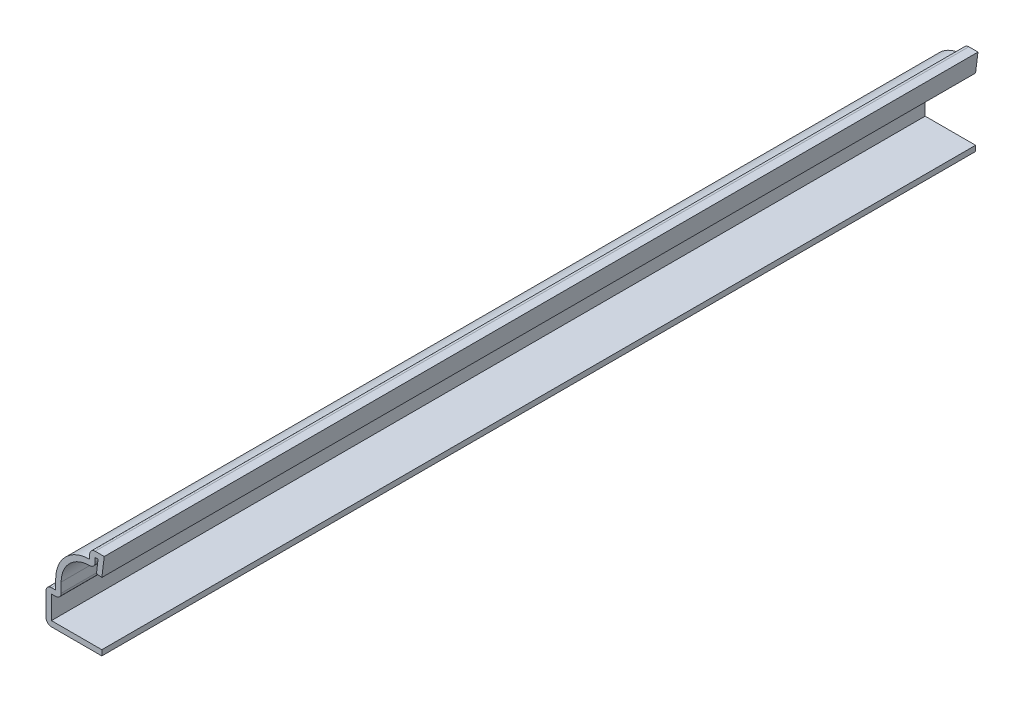
ISO-10303-21;
HEADER;
FILE_DESCRIPTION(('STEP AP214'),'2;1');
FILE_NAME('part.step','',(''),(''),'','','');
FILE_SCHEMA(('AUTOMOTIVE_DESIGN { 1 0 10303 214 1 1 1 1 }'));
ENDSEC;
DATA;
#1=APPLICATION_CONTEXT('core data for automotive mechanical design processes');
#2=APPLICATION_PROTOCOL_DEFINITION('international standard','automotive_design',2000,#1);
#3=PRODUCT_CONTEXT('',#1,'mechanical');
#4=PRODUCT('Part','Part','',(#3));
#5=PRODUCT_RELATED_PRODUCT_CATEGORY('part','',(#4));
#6=PRODUCT_DEFINITION_FORMATION('','',#4);
#7=PRODUCT_DEFINITION_CONTEXT('part definition',#1,'design');
#8=PRODUCT_DEFINITION('design','',#6,#7);
#9=PRODUCT_DEFINITION_SHAPE('','',#8);
#10=(LENGTH_UNIT() NAMED_UNIT(*) SI_UNIT(.MILLI.,.METRE.));
#11=(NAMED_UNIT(*) PLANE_ANGLE_UNIT() SI_UNIT($,.RADIAN.));
#12=(NAMED_UNIT(*) SI_UNIT($,.STERADIAN.) SOLID_ANGLE_UNIT());
#13=UNCERTAINTY_MEASURE_WITH_UNIT(LENGTH_MEASURE(1.E-05),#10,'distance_accuracy_value','');
#14=(GEOMETRIC_REPRESENTATION_CONTEXT(3) GLOBAL_UNCERTAINTY_ASSIGNED_CONTEXT((#13)) GLOBAL_UNIT_ASSIGNED_CONTEXT((#10,
#11,#12)) REPRESENTATION_CONTEXT('',''));
#15=CARTESIAN_POINT('',(0.,0.,0.));
#16=DIRECTION('',(0.,0.,1.));
#17=DIRECTION('',(1.,0.,0.));
#18=AXIS2_PLACEMENT_3D('',#15,#16,#17);
#19=CARTESIAN_POINT('',(-0.882135032398451,14.3977668790498,-142.875));
#20=DIRECTION('',(-0.992277876713668,0.124034734589208,0.));
#21=DIRECTION('',(-0.124034734589208,-0.992277876713668,0.));
#22=AXIS2_PLACEMENT_3D('',#19,#20,#21);
#23=PLANE('',#22);
#24=DIRECTION('',(-0.124034734589208,-0.992277876713668,0.));
#25=VECTOR('',#24,1.);
#26=CARTESIAN_POINT('',(-0.882135032398451,14.3977668790498,0.));
#27=LINE('',#26,#25);
#28=CARTESIAN_POINT('',(-1.00704339227968,13.3985,0.));
#29=VERTEX_POINT('',#28);
#30=CARTESIAN_POINT('',(-1.27901003239845,11.2227668790498,0.));
#31=VERTEX_POINT('',#30);
#32=EDGE_CURVE('E256',#29,#31,#27,.T.);
#33=ORIENTED_EDGE('',*,*,#32,.F.);
#34=DIRECTION('',(0.,0.,1.));
#35=VECTOR('',#34,1.);
#36=CARTESIAN_POINT('',(-1.00704339227968,13.3985,-142.875));
#37=LINE('',#36,#35);
#38=CARTESIAN_POINT('',(-1.00704339227968,13.3985,-142.875));
#39=VERTEX_POINT('',#38);
#40=EDGE_CURVE('E214',#39,#29,#37,.T.);
#41=ORIENTED_EDGE('',*,*,#40,.F.);
#42=DIRECTION('',(-0.124034734589208,-0.992277876713668,0.));
#43=VECTOR('',#42,1.);
#44=CARTESIAN_POINT('',(-0.882135032398451,14.3977668790498,-142.875));
#45=LINE('',#44,#43);
#46=CARTESIAN_POINT('',(-1.27901003239845,11.2227668790498,-142.875));
#47=VERTEX_POINT('',#46);
#48=EDGE_CURVE('E195',#39,#47,#45,.T.);
#49=ORIENTED_EDGE('',*,*,#48,.T.);
#50=DIRECTION('',(0.,0.,1.));
#51=VECTOR('',#50,1.);
#52=CARTESIAN_POINT('',(-1.27901003239845,11.2227668790498,-142.875));
#53=LINE('',#52,#51);
#54=EDGE_CURVE('E204',#47,#31,#53,.T.);
#55=ORIENTED_EDGE('',*,*,#54,.T.);
#56=EDGE_LOOP('',(#33,#41,#49,#55));
#57=FACE_BOUND('',#56,.T.);
#58=ADVANCED_FACE('F35',(#57),#23,.T.);
#59=CARTESIAN_POINT('',(-2.38125,13.3985,-142.875));
#60=DIRECTION('',(0.,-1.,0.));
#61=DIRECTION('',(1.,0.,0.));
#62=AXIS2_PLACEMENT_3D('',#59,#60,#61);
#63=PLANE('',#62);
#64=DIRECTION('',(1.,0.,0.));
#65=VECTOR('',#64,1.);
#66=CARTESIAN_POINT('',(-2.38125,13.3985,0.));
#67=LINE('',#66,#65);
#68=CARTESIAN_POINT('',(-1.49225,13.3985,0.));
#69=VERTEX_POINT('',#68);
#70=EDGE_CURVE('E215',#69,#29,#67,.T.);
#71=ORIENTED_EDGE('',*,*,#70,.F.);
#72=DIRECTION('',(0.,0.,1.));
#73=VECTOR('',#72,1.);
#74=CARTESIAN_POINT('',(-1.49225,13.3985,-142.875));
#75=LINE('',#74,#73);
#76=CARTESIAN_POINT('',(-1.49225,13.3985,-142.875));
#77=VERTEX_POINT('',#76);
#78=EDGE_CURVE('E296',#77,#69,#75,.T.);
#79=ORIENTED_EDGE('',*,*,#78,.F.);
#80=DIRECTION('',(1.,0.,0.));
#81=VECTOR('',#80,1.);
#82=CARTESIAN_POINT('',(-2.38125,13.3985,-142.875));
#83=LINE('',#82,#81);
#84=EDGE_CURVE('E212',#77,#39,#83,.T.);
#85=ORIENTED_EDGE('',*,*,#84,.T.);
#86=ORIENTED_EDGE('',*,*,#40,.T.);
#87=EDGE_LOOP('',(#71,#79,#85,#86));
#88=FACE_BOUND('',#87,.T.);
#89=ADVANCED_FACE('F385',(#88),#63,.T.);
#90=CARTESIAN_POINT('',(-1.49225,12.7,-142.875));
#91=DIRECTION('',(1.,0.,0.));
#92=DIRECTION('',(0.,1.,0.));
#93=AXIS2_PLACEMENT_3D('',#90,#91,#92);
#94=PLANE('',#93);
#95=DIRECTION('',(0.,1.,0.));
#96=VECTOR('',#95,1.);
#97=CARTESIAN_POINT('',(-1.49225,12.7,0.));
#98=LINE('',#97,#96);
#99=CARTESIAN_POINT('',(-1.49225,12.7,0.));
#100=VERTEX_POINT('',#99);
#101=EDGE_CURVE('E218',#100,#69,#98,.T.);
#102=ORIENTED_EDGE('',*,*,#101,.F.);
#103=DIRECTION('',(0.,0.,1.));
#104=VECTOR('',#103,1.);
#105=CARTESIAN_POINT('',(-1.49225,12.7,-142.875));
#106=LINE('',#105,#104);
#107=CARTESIAN_POINT('',(-1.49225,12.7,-142.875));
#108=VERTEX_POINT('',#107);
#109=EDGE_CURVE('E360',#100,#108,#106,.F.);
#110=ORIENTED_EDGE('',*,*,#109,.T.);
#111=DIRECTION('',(0.,1.,0.));
#112=VECTOR('',#111,1.);
#113=CARTESIAN_POINT('',(-1.49225,12.7,-142.875));
#114=LINE('',#113,#112);
#115=EDGE_CURVE('E253',#108,#77,#114,.T.);
#116=ORIENTED_EDGE('',*,*,#115,.T.);
#117=ORIENTED_EDGE('',*,*,#78,.T.);
#118=EDGE_LOOP('',(#102,#110,#116,#117));
#119=FACE_BOUND('',#118,.T.);
#120=ADVANCED_FACE('F390',(#119),#94,.T.);
#121=CARTESIAN_POINT('',(-2.38125,7.14375,-142.875));
#122=DIRECTION('',(0.,0.,1.));
#123=DIRECTION('',(1.,0.,0.));
#124=AXIS2_PLACEMENT_3D('',#121,#122,#123);
#125=CYLINDRICAL_SURFACE('',#124,4.66725);
#126=CARTESIAN_POINT('',(-2.38125,7.14375,-142.875));
#127=DIRECTION('',(0.,0.,1.));
#128=DIRECTION('',(1.,0.,0.));
#129=AXIS2_PLACEMENT_3D('',#126,#127,#128);
#130=CIRCLE('',#129,4.66725);
#131=CARTESIAN_POINT('',(-7.0485,7.14375,-142.875));
#132=VERTEX_POINT('',#131);
#133=CARTESIAN_POINT('',(-2.38125,11.811,-142.875));
#134=VERTEX_POINT('',#133);
#135=EDGE_CURVE('E250',#132,#134,#130,.F.);
#136=ORIENTED_EDGE('',*,*,#135,.T.);
#137=DIRECTION('',(0.,0.,1.));
#138=VECTOR('',#137,1.);
#139=CARTESIAN_POINT('',(-2.38125,11.811,-142.875));
#140=LINE('',#139,#138);
#141=CARTESIAN_POINT('',(-2.38125,11.811,0.));
#142=VERTEX_POINT('',#141);
#143=EDGE_CURVE('E357',#134,#142,#140,.T.);
#144=ORIENTED_EDGE('',*,*,#143,.T.);
#145=CARTESIAN_POINT('',(-2.38125,7.14375,0.));
#146=DIRECTION('',(0.,0.,1.));
#147=DIRECTION('',(1.,0.,0.));
#148=AXIS2_PLACEMENT_3D('',#145,#146,#147);
#149=CIRCLE('',#148,4.66725);
#150=CARTESIAN_POINT('',(-7.0485,7.14375,0.));
#151=VERTEX_POINT('',#150);
#152=EDGE_CURVE('E290',#151,#142,#149,.F.);
#153=ORIENTED_EDGE('',*,*,#152,.F.);
#154=DIRECTION('',(0.,0.,1.));
#155=VECTOR('',#154,1.);
#156=CARTESIAN_POINT('',(-7.0485,7.14375,-142.875));
#157=LINE('',#156,#155);
#158=EDGE_CURVE('E299',#132,#151,#157,.T.);
#159=ORIENTED_EDGE('',*,*,#158,.F.);
#160=EDGE_LOOP('',(#136,#144,#153,#159));
#161=FACE_BOUND('',#160,.T.);
#162=ADVANCED_FACE('F419',(#161),#125,.F.);
#163=CARTESIAN_POINT('',(-7.0485,5.55625,-142.875));
#164=DIRECTION('',(1.,0.,0.));
#165=DIRECTION('',(0.,0.,-1.));
#166=AXIS2_PLACEMENT_3D('',#163,#164,#165);
#167=PLANE('',#166);
#168=DIRECTION('',(0.,1.,0.));
#169=VECTOR('',#168,1.);
#170=CARTESIAN_POINT('',(-7.0485,5.55625,0.));
#171=LINE('',#170,#169);
#172=CARTESIAN_POINT('',(-7.0485,5.55625,0.));
#173=VERTEX_POINT('',#172);
#174=EDGE_CURVE('E288',#173,#151,#171,.T.);
#175=ORIENTED_EDGE('',*,*,#174,.F.);
#176=DIRECTION('',(0.,0.,1.));
#177=VECTOR('',#176,1.);
#178=CARTESIAN_POINT('',(-7.0485,5.55625,-142.875));
#179=LINE('',#178,#177);
#180=CARTESIAN_POINT('',(-7.0485,5.55625,-142.875));
#181=VERTEX_POINT('',#180);
#182=EDGE_CURVE('E355',#173,#181,#179,.F.);
#183=ORIENTED_EDGE('',*,*,#182,.T.);
#184=DIRECTION('',(0.,1.,0.));
#185=VECTOR('',#184,1.);
#186=CARTESIAN_POINT('',(-7.0485,5.55625,-142.875));
#187=LINE('',#186,#185);
#188=EDGE_CURVE('E248',#181,#132,#187,.T.);
#189=ORIENTED_EDGE('',*,*,#188,.T.);
#190=ORIENTED_EDGE('',*,*,#158,.T.);
#191=EDGE_LOOP('',(#175,#183,#189,#190));
#192=FACE_BOUND('',#191,.T.);
#193=ADVANCED_FACE('F423',(#192),#167,.T.);
#194=CARTESIAN_POINT('',(-9.525,4.66725,-142.875));
#195=DIRECTION('',(0.,-1.,0.));
#196=DIRECTION('',(0.,0.,-1.));
#197=AXIS2_PLACEMENT_3D('',#194,#195,#196);
#198=PLANE('',#197);
#199=DIRECTION('',(1.,0.,0.));
#200=VECTOR('',#199,1.);
#201=CARTESIAN_POINT('',(-9.525,4.66725,-142.875));
#202=LINE('',#201,#200);
#203=CARTESIAN_POINT('',(-8.636,4.66725,-142.875));
#204=VERTEX_POINT('',#203);
#205=CARTESIAN_POINT('',(-7.9375,4.66725,-142.875));
#206=VERTEX_POINT('',#205);
#207=EDGE_CURVE('E245',#204,#206,#202,.T.);
#208=ORIENTED_EDGE('',*,*,#207,.T.);
#209=DIRECTION('',(0.,0.,1.));
#210=VECTOR('',#209,1.);
#211=CARTESIAN_POINT('',(-7.9375,4.66725,-142.875));
#212=LINE('',#211,#210);
#213=CARTESIAN_POINT('',(-7.9375,4.66725,0.));
#214=VERTEX_POINT('',#213);
#215=EDGE_CURVE('E352',#206,#214,#212,.T.);
#216=ORIENTED_EDGE('',*,*,#215,.T.);
#217=DIRECTION('',(1.,0.,0.));
#218=VECTOR('',#217,1.);
#219=CARTESIAN_POINT('',(-9.525,4.66725,0.));
#220=LINE('',#219,#218);
#221=CARTESIAN_POINT('',(-8.636,4.66725,0.));
#222=VERTEX_POINT('',#221);
#223=EDGE_CURVE('E285',#222,#214,#220,.T.);
#224=ORIENTED_EDGE('',*,*,#223,.F.);
#225=DIRECTION('',(0.,0.,1.));
#226=VECTOR('',#225,1.);
#227=CARTESIAN_POINT('',(-8.636,4.66725,-142.875));
#228=LINE('',#227,#226);
#229=EDGE_CURVE('E302',#204,#222,#228,.T.);
#230=ORIENTED_EDGE('',*,*,#229,.F.);
#231=EDGE_LOOP('',(#208,#216,#224,#230));
#232=FACE_BOUND('',#231,.T.);
#233=ADVANCED_FACE('F430',(#232),#198,.T.);
#234=CARTESIAN_POINT('',(-8.636,0.,-142.875));
#235=DIRECTION('',(1.,0.,0.));
#236=DIRECTION('',(0.,0.,-1.));
#237=AXIS2_PLACEMENT_3D('',#234,#235,#236);
#238=PLANE('',#237);
#239=DIRECTION('',(0.,1.,0.));
#240=VECTOR('',#239,1.);
#241=CARTESIAN_POINT('',(-8.636,0.,0.));
#242=LINE('',#241,#240);
#243=CARTESIAN_POINT('',(-8.636,0.888999999999999,0.));
#244=VERTEX_POINT('',#243);
#245=EDGE_CURVE('E282',#244,#222,#242,.T.);
#246=ORIENTED_EDGE('',*,*,#245,.F.);
#247=DIRECTION('',(0.,0.,1.));
#248=VECTOR('',#247,1.);
#249=CARTESIAN_POINT('',(-8.636,0.888999999999999,-142.875));
#250=LINE('',#249,#248);
#251=CARTESIAN_POINT('',(-8.636,0.888999999999999,-142.875));
#252=VERTEX_POINT('',#251);
#253=EDGE_CURVE('E304',#252,#244,#250,.T.);
#254=ORIENTED_EDGE('',*,*,#253,.F.);
#255=DIRECTION('',(0.,1.,0.));
#256=VECTOR('',#255,1.);
#257=CARTESIAN_POINT('',(-8.636,0.,-142.875));
#258=LINE('',#257,#256);
#259=EDGE_CURVE('E242',#252,#204,#258,.T.);
#260=ORIENTED_EDGE('',*,*,#259,.T.);
#261=ORIENTED_EDGE('',*,*,#229,.T.);
#262=EDGE_LOOP('',(#246,#254,#260,#261));
#263=FACE_BOUND('',#262,.T.);
#264=ADVANCED_FACE('F435',(#263),#238,.T.);
#265=CARTESIAN_POINT('',(-0.396875,0.889,-142.875));
#266=DIRECTION('',(0.,1.,0.));
#267=DIRECTION('',(-1.,0.,0.));
#268=AXIS2_PLACEMENT_3D('',#265,#266,#267);
#269=PLANE('',#268);
#270=DIRECTION('',(-1.,0.,0.));
#271=VECTOR('',#270,1.);
#272=CARTESIAN_POINT('',(-0.396875,0.889,0.));
#273=LINE('',#272,#271);
#274=CARTESIAN_POINT('',(-0.396875,0.889,0.));
#275=VERTEX_POINT('',#274);
#276=EDGE_CURVE('E279',#275,#244,#273,.T.);
#277=ORIENTED_EDGE('',*,*,#276,.F.);
#278=DIRECTION('',(0.,0.,1.));
#279=VECTOR('',#278,1.);
#280=CARTESIAN_POINT('',(-0.396875,0.889,-142.875));
#281=LINE('',#280,#279);
#282=CARTESIAN_POINT('',(-0.396875,0.889,-142.875));
#283=VERTEX_POINT('',#282);
#284=EDGE_CURVE('E306',#283,#275,#281,.T.);
#285=ORIENTED_EDGE('',*,*,#284,.F.);
#286=DIRECTION('',(-1.,0.,0.));
#287=VECTOR('',#286,1.);
#288=CARTESIAN_POINT('',(-0.396875,0.889,-142.875));
#289=LINE('',#288,#287);
#290=EDGE_CURVE('E239',#283,#252,#289,.T.);
#291=ORIENTED_EDGE('',*,*,#290,.T.);
#292=ORIENTED_EDGE('',*,*,#253,.T.);
#293=EDGE_LOOP('',(#277,#285,#291,#292));
#294=FACE_BOUND('',#293,.T.);
#295=ADVANCED_FACE('F439',(#294),#269,.T.);
#296=CARTESIAN_POINT('',(-0.396875,0.889,-142.875));
#297=DIRECTION('',(-1.,0.,0.));
#298=DIRECTION('',(0.,-1.,0.));
#299=AXIS2_PLACEMENT_3D('',#296,#297,#298);
#300=PLANE('',#299);
#301=DIRECTION('',(0.,-1.,0.));
#302=VECTOR('',#301,1.);
#303=CARTESIAN_POINT('',(-0.396875,0.889,0.));
#304=LINE('',#303,#302);
#305=CARTESIAN_POINT('',(-0.396875,0.,0.));
#306=VERTEX_POINT('',#305);
#307=EDGE_CURVE('E277',#275,#306,#304,.T.);
#308=ORIENTED_EDGE('',*,*,#307,.T.);
#309=DIRECTION('',(0.,0.,1.));
#310=VECTOR('',#309,1.);
#311=CARTESIAN_POINT('',(-0.396875,0.,-142.875));
#312=LINE('',#311,#310);
#313=CARTESIAN_POINT('',(-0.396875,0.,-142.875));
#314=VERTEX_POINT('',#313);
#315=EDGE_CURVE('E308',#314,#306,#312,.T.);
#316=ORIENTED_EDGE('',*,*,#315,.F.);
#317=DIRECTION('',(0.,-1.,0.));
#318=VECTOR('',#317,1.);
#319=CARTESIAN_POINT('',(-0.396875,0.889,-142.875));
#320=LINE('',#319,#318);
#321=EDGE_CURVE('E237',#283,#314,#320,.T.);
#322=ORIENTED_EDGE('',*,*,#321,.F.);
#323=ORIENTED_EDGE('',*,*,#284,.T.);
#324=EDGE_LOOP('',(#308,#316,#322,#323));
#325=FACE_BOUND('',#324,.T.);
#326=ADVANCED_FACE('F443',(#325),#300,.F.);
#327=CARTESIAN_POINT('',(-0.396875,0.,-142.875));
#328=DIRECTION('',(0.,1.,0.));
#329=DIRECTION('',(-1.,0.,0.));
#330=AXIS2_PLACEMENT_3D('',#327,#328,#329);
#331=PLANE('',#330);
#332=DIRECTION('',(-1.,0.,0.));
#333=VECTOR('',#332,1.);
#334=CARTESIAN_POINT('',(-0.396875,0.,0.));
#335=LINE('',#334,#333);
#336=CARTESIAN_POINT('',(-8.636,0.,0.));
#337=VERTEX_POINT('',#336);
#338=EDGE_CURVE('E274',#306,#337,#335,.T.);
#339=ORIENTED_EDGE('',*,*,#338,.T.);
#340=DIRECTION('',(0.,0.,1.));
#341=VECTOR('',#340,1.);
#342=CARTESIAN_POINT('',(-8.636,0.,-142.875));
#343=LINE('',#342,#341);
#344=CARTESIAN_POINT('',(-8.636,0.,-142.875));
#345=VERTEX_POINT('',#344);
#346=EDGE_CURVE('E338',#337,#345,#343,.F.);
#347=ORIENTED_EDGE('',*,*,#346,.T.);
#348=DIRECTION('',(-1.,0.,0.));
#349=VECTOR('',#348,1.);
#350=CARTESIAN_POINT('',(-0.396875,0.,-142.875));
#351=LINE('',#350,#349);
#352=EDGE_CURVE('E235',#314,#345,#351,.T.);
#353=ORIENTED_EDGE('',*,*,#352,.F.);
#354=ORIENTED_EDGE('',*,*,#315,.T.);
#355=EDGE_LOOP('',(#339,#347,#353,#354));
#356=FACE_BOUND('',#355,.T.);
#357=ADVANCED_FACE('F484',(#356),#331,.F.);
#358=CARTESIAN_POINT('',(-9.525,0.,-142.875));
#359=DIRECTION('',(1.,0.,0.));
#360=DIRECTION('',(0.,0.,-1.));
#361=AXIS2_PLACEMENT_3D('',#358,#359,#360);
#362=PLANE('',#361);
#363=DIRECTION('',(0.,1.,0.));
#364=VECTOR('',#363,1.);
#365=CARTESIAN_POINT('',(-9.525,0.,-142.875));
#366=LINE('',#365,#364);
#367=CARTESIAN_POINT('',(-9.525,0.888999999999999,-142.875));
#368=VERTEX_POINT('',#367);
#369=CARTESIAN_POINT('',(-9.525,4.66725,-142.875));
#370=VERTEX_POINT('',#369);
#371=EDGE_CURVE('E232',#368,#370,#366,.T.);
#372=ORIENTED_EDGE('',*,*,#371,.F.);
#373=DIRECTION('',(0.,0.,1.));
#374=VECTOR('',#373,1.);
#375=CARTESIAN_POINT('',(-9.525,0.888999999999999,-142.875));
#376=LINE('',#375,#374);
#377=CARTESIAN_POINT('',(-9.525,0.888999999999999,0.));
#378=VERTEX_POINT('',#377);
#379=EDGE_CURVE('E325',#368,#378,#376,.T.);
#380=ORIENTED_EDGE('',*,*,#379,.T.);
#381=DIRECTION('',(0.,1.,0.));
#382=VECTOR('',#381,1.);
#383=CARTESIAN_POINT('',(-9.525,0.,0.));
#384=LINE('',#383,#382);
#385=CARTESIAN_POINT('',(-9.525,4.66725,0.));
#386=VERTEX_POINT('',#385);
#387=EDGE_CURVE('E271',#378,#386,#384,.T.);
#388=ORIENTED_EDGE('',*,*,#387,.T.);
#389=DIRECTION('',(0.,0.,1.));
#390=VECTOR('',#389,1.);
#391=CARTESIAN_POINT('',(-9.525,4.66725,-142.875));
#392=LINE('',#391,#390);
#393=EDGE_CURVE('E295',#386,#370,#392,.F.);
#394=ORIENTED_EDGE('',*,*,#393,.T.);
#395=EDGE_LOOP('',(#372,#380,#388,#394));
#396=FACE_BOUND('',#395,.T.);
#397=ADVANCED_FACE('F451',(#396),#362,.F.);
#398=CARTESIAN_POINT('',(-9.525,5.55625,-142.875));
#399=DIRECTION('',(0.,-1.,0.));
#400=DIRECTION('',(0.,0.,-1.));
#401=AXIS2_PLACEMENT_3D('',#398,#399,#400);
#402=PLANE('',#401);
#403=DIRECTION('',(1.,0.,0.));
#404=VECTOR('',#403,1.);
#405=CARTESIAN_POINT('',(-9.525,5.55625,-142.875));
#406=LINE('',#405,#404);
#407=CARTESIAN_POINT('',(-8.636,5.55625,-142.875));
#408=VERTEX_POINT('',#407);
#409=CARTESIAN_POINT('',(-7.9375,5.55625,-142.875));
#410=VERTEX_POINT('',#409);
#411=EDGE_CURVE('E230',#408,#410,#406,.T.);
#412=ORIENTED_EDGE('',*,*,#411,.F.);
#413=DIRECTION('',(0.,0.,1.));
#414=VECTOR('',#413,1.);
#415=CARTESIAN_POINT('',(-8.636,5.55625,-142.875));
#416=LINE('',#415,#414);
#417=CARTESIAN_POINT('',(-8.636,5.55625,0.));
#418=VERTEX_POINT('',#417);
#419=EDGE_CURVE('E349',#408,#418,#416,.T.);
#420=ORIENTED_EDGE('',*,*,#419,.T.);
#421=DIRECTION('',(1.,0.,0.));
#422=VECTOR('',#421,1.);
#423=CARTESIAN_POINT('',(-9.525,5.55625,0.));
#424=LINE('',#423,#422);
#425=CARTESIAN_POINT('',(-7.9375,5.55625,0.));
#426=VERTEX_POINT('',#425);
#427=EDGE_CURVE('E269',#418,#426,#424,.T.);
#428=ORIENTED_EDGE('',*,*,#427,.T.);
#429=DIRECTION('',(0.,0.,1.));
#430=VECTOR('',#429,1.);
#431=CARTESIAN_POINT('',(-7.9375,5.55625,-142.875));
#432=LINE('',#431,#430);
#433=EDGE_CURVE('E311',#410,#426,#432,.T.);
#434=ORIENTED_EDGE('',*,*,#433,.F.);
#435=EDGE_LOOP('',(#412,#420,#428,#434));
#436=FACE_BOUND('',#435,.T.);
#437=ADVANCED_FACE('F460',(#436),#402,.F.);
#438=CARTESIAN_POINT('',(-7.9375,5.55625,-142.875));
#439=DIRECTION('',(1.,0.,0.));
#440=DIRECTION('',(0.,0.,-1.));
#441=AXIS2_PLACEMENT_3D('',#438,#439,#440);
#442=PLANE('',#441);
#443=DIRECTION('',(0.,1.,0.));
#444=VECTOR('',#443,1.);
#445=CARTESIAN_POINT('',(-7.9375,5.55625,0.));
#446=LINE('',#445,#444);
#447=CARTESIAN_POINT('',(-7.9375,7.14375,0.));
#448=VERTEX_POINT('',#447);
#449=EDGE_CURVE('E267',#426,#448,#446,.T.);
#450=ORIENTED_EDGE('',*,*,#449,.T.);
#451=DIRECTION('',(0.,0.,1.));
#452=VECTOR('',#451,1.);
#453=CARTESIAN_POINT('',(-7.9375,7.14375,-142.875));
#454=LINE('',#453,#452);
#455=CARTESIAN_POINT('',(-7.9375,7.14375,-142.875));
#456=VERTEX_POINT('',#455);
#457=EDGE_CURVE('E314',#456,#448,#454,.T.);
#458=ORIENTED_EDGE('',*,*,#457,.F.);
#459=DIRECTION('',(0.,1.,0.));
#460=VECTOR('',#459,1.);
#461=CARTESIAN_POINT('',(-7.9375,5.55625,-142.875));
#462=LINE('',#461,#460);
#463=EDGE_CURVE('E228',#410,#456,#462,.T.);
#464=ORIENTED_EDGE('',*,*,#463,.F.);
#465=ORIENTED_EDGE('',*,*,#433,.T.);
#466=EDGE_LOOP('',(#450,#458,#464,#465));
#467=FACE_BOUND('',#466,.T.);
#468=ADVANCED_FACE('F467',(#467),#442,.F.);
#469=CARTESIAN_POINT('',(-2.38125,7.14375,-142.875));
#470=DIRECTION('',(0.,0.,1.));
#471=DIRECTION('',(1.,0.,0.));
#472=AXIS2_PLACEMENT_3D('',#469,#470,#471);
#473=CYLINDRICAL_SURFACE('',#472,5.55625);
#474=CARTESIAN_POINT('',(-2.38125,7.14375,0.));
#475=DIRECTION('',(0.,0.,-1.));
#476=DIRECTION('',(-1.,0.,0.));
#477=AXIS2_PLACEMENT_3D('',#474,#475,#476);
#478=CIRCLE('',#477,5.55625);
#479=CARTESIAN_POINT('',(-2.38125,12.7,0.));
#480=VERTEX_POINT('',#479);
#481=EDGE_CURVE('E265',#448,#480,#478,.T.);
#482=ORIENTED_EDGE('',*,*,#481,.T.);
#483=DIRECTION('',(0.,0.,1.));
#484=VECTOR('',#483,1.);
#485=CARTESIAN_POINT('',(-2.38125,12.7,-142.875));
#486=LINE('',#485,#484);
#487=CARTESIAN_POINT('',(-2.38125,12.7,-142.875));
#488=VERTEX_POINT('',#487);
#489=EDGE_CURVE('E317',#488,#480,#486,.T.);
#490=ORIENTED_EDGE('',*,*,#489,.F.);
#491=CARTESIAN_POINT('',(-2.38125,7.14375,-142.875));
#492=DIRECTION('',(0.,0.,-1.));
#493=DIRECTION('',(-1.,0.,0.));
#494=AXIS2_PLACEMENT_3D('',#491,#492,#493);
#495=CIRCLE('',#494,5.55625);
#496=EDGE_CURVE('E226',#456,#488,#495,.T.);
#497=ORIENTED_EDGE('',*,*,#496,.F.);
#498=ORIENTED_EDGE('',*,*,#457,.T.);
#499=EDGE_LOOP('',(#482,#490,#497,#498));
#500=FACE_BOUND('',#499,.T.);
#501=ADVANCED_FACE('F470',(#500),#473,.T.);
#502=CARTESIAN_POINT('',(-2.38125,12.7,-142.875));
#503=DIRECTION('',(1.,0.,0.));
#504=DIRECTION('',(0.,1.,0.));
#505=AXIS2_PLACEMENT_3D('',#502,#503,#504);
#506=PLANE('',#505);
#507=DIRECTION('',(0.,1.,0.));
#508=VECTOR('',#507,1.);
#509=CARTESIAN_POINT('',(-2.38125,12.7,0.));
#510=LINE('',#509,#508);
#511=CARTESIAN_POINT('',(-2.38125,13.3985,0.));
#512=VERTEX_POINT('',#511);
#513=EDGE_CURVE('E263',#480,#512,#510,.T.);
#514=ORIENTED_EDGE('',*,*,#513,.T.);
#515=DIRECTION('',(0.,0.,1.));
#516=VECTOR('',#515,1.);
#517=CARTESIAN_POINT('',(-2.38125,13.3985,-142.875));
#518=LINE('',#517,#516);
#519=CARTESIAN_POINT('',(-2.38125,13.3985,-142.875));
#520=VERTEX_POINT('',#519);
#521=EDGE_CURVE('E11',#512,#520,#518,.F.);
#522=ORIENTED_EDGE('',*,*,#521,.T.);
#523=DIRECTION('',(0.,1.,0.));
#524=VECTOR('',#523,1.);
#525=CARTESIAN_POINT('',(-2.38125,12.7,-142.875));
#526=LINE('',#525,#524);
#527=EDGE_CURVE('E224',#488,#520,#526,.T.);
#528=ORIENTED_EDGE('',*,*,#527,.F.);
#529=ORIENTED_EDGE('',*,*,#489,.T.);
#530=EDGE_LOOP('',(#514,#522,#528,#529));
#531=FACE_BOUND('',#530,.T.);
#532=ADVANCED_FACE('F382',(#531),#506,.F.);
#533=CARTESIAN_POINT('',(-2.38125,14.2875,-142.875));
#534=DIRECTION('',(0.,-1.,0.));
#535=DIRECTION('',(1.,0.,0.));
#536=AXIS2_PLACEMENT_3D('',#533,#534,#535);
#537=PLANE('',#536);
#538=DIRECTION('',(1.,0.,0.));
#539=VECTOR('',#538,1.);
#540=CARTESIAN_POINT('',(-2.38125,14.2875,-142.875));
#541=LINE('',#540,#539);
#542=CARTESIAN_POINT('',(-1.49225,14.2875,-142.875));
#543=VERTEX_POINT('',#542);
#544=CARTESIAN_POINT('',(0.,14.2875,-142.875));
#545=VERTEX_POINT('',#544);
#546=EDGE_CURVE('E222',#543,#545,#541,.T.);
#547=ORIENTED_EDGE('',*,*,#546,.F.);
#548=DIRECTION('',(0.,0.,1.));
#549=VECTOR('',#548,1.);
#550=CARTESIAN_POINT('',(-1.49225,14.2875,-142.875));
#551=LINE('',#550,#549);
#552=CARTESIAN_POINT('',(-1.49225,14.2875,0.));
#553=VERTEX_POINT('',#552);
#554=EDGE_CURVE('E43',#543,#553,#551,.T.);
#555=ORIENTED_EDGE('',*,*,#554,.T.);
#556=DIRECTION('',(1.,0.,0.));
#557=VECTOR('',#556,1.);
#558=CARTESIAN_POINT('',(-2.38125,14.2875,0.));
#559=LINE('',#558,#557);
#560=CARTESIAN_POINT('',(0.,14.2875,0.));
#561=VERTEX_POINT('',#560);
#562=EDGE_CURVE('E261',#553,#561,#559,.T.);
#563=ORIENTED_EDGE('',*,*,#562,.T.);
#564=DIRECTION('',(0.,0.,1.));
#565=VECTOR('',#564,1.);
#566=CARTESIAN_POINT('',(0.,14.2875,-142.875));
#567=LINE('',#566,#565);
#568=EDGE_CURVE('E320',#545,#561,#567,.T.);
#569=ORIENTED_EDGE('',*,*,#568,.F.);
#570=EDGE_LOOP('',(#547,#555,#563,#569));
#571=FACE_BOUND('',#570,.T.);
#572=ADVANCED_FACE('F365',(#571),#537,.F.);
#573=CARTESIAN_POINT('',(0.,14.2875,-142.875));
#574=DIRECTION('',(-0.992277876713668,0.124034734589208,0.));
#575=DIRECTION('',(-0.124034734589208,-0.992277876713668,0.));
#576=AXIS2_PLACEMENT_3D('',#573,#574,#575);
#577=PLANE('',#576);
#578=DIRECTION('',(-0.124034734589208,-0.992277876713668,0.));
#579=VECTOR('',#578,1.);
#580=CARTESIAN_POINT('',(0.,14.2875,0.));
#581=LINE('',#580,#579);
#582=CARTESIAN_POINT('',(-0.396875,11.1125,0.));
#583=VERTEX_POINT('',#582);
#584=EDGE_CURVE('E259',#561,#583,#581,.T.);
#585=ORIENTED_EDGE('',*,*,#584,.T.);
#586=DIRECTION('',(0.,0.,1.));
#587=VECTOR('',#586,1.);
#588=CARTESIAN_POINT('',(-0.396875,11.1125,-142.875));
#589=LINE('',#588,#587);
#590=CARTESIAN_POINT('',(-0.396875,11.1125,-142.875));
#591=VERTEX_POINT('',#590);
#592=EDGE_CURVE('E211',#591,#583,#589,.T.);
#593=ORIENTED_EDGE('',*,*,#592,.F.);
#594=DIRECTION('',(-0.124034734589208,-0.992277876713668,0.));
#595=VECTOR('',#594,1.);
#596=CARTESIAN_POINT('',(0.,14.2875,-142.875));
#597=LINE('',#596,#595);
#598=EDGE_CURVE('E198',#545,#591,#597,.T.);
#599=ORIENTED_EDGE('',*,*,#598,.F.);
#600=ORIENTED_EDGE('',*,*,#568,.T.);
#601=EDGE_LOOP('',(#585,#593,#599,#600));
#602=FACE_BOUND('',#601,.T.);
#603=ADVANCED_FACE('F374',(#602),#577,.F.);
#604=CARTESIAN_POINT('',(-0.396875,11.1125,-142.875));
#605=DIRECTION('',(0.124034734589209,0.992277876713668,0.));
#606=DIRECTION('',(-0.992277876713668,0.124034734589209,0.));
#607=AXIS2_PLACEMENT_3D('',#604,#605,#606);
#608=PLANE('',#607);
#609=DIRECTION('',(-0.992277876713668,0.124034734589209,0.));
#610=VECTOR('',#609,1.);
#611=CARTESIAN_POINT('',(-0.396875,11.1125,0.));
#612=LINE('',#611,#610);
#613=EDGE_CURVE('E207',#583,#31,#612,.T.);
#614=ORIENTED_EDGE('',*,*,#613,.T.);
#615=ORIENTED_EDGE('',*,*,#54,.F.);
#616=DIRECTION('',(-0.992277876713668,0.124034734589209,0.));
#617=VECTOR('',#616,1.);
#618=CARTESIAN_POINT('',(-0.396875,11.1125,-142.875));
#619=LINE('',#618,#617);
#620=EDGE_CURVE('E189',#591,#47,#619,.T.);
#621=ORIENTED_EDGE('',*,*,#620,.F.);
#622=ORIENTED_EDGE('',*,*,#592,.T.);
#623=EDGE_LOOP('',(#614,#615,#621,#622));
#624=FACE_BOUND('',#623,.T.);
#625=ADVANCED_FACE('F205',(#624),#608,.F.);
#626=CARTESIAN_POINT('',(-2.38125,7.14375,-142.875));
#627=DIRECTION('',(0.,0.,-1.));
#628=DIRECTION('',(-1.,0.,0.));
#629=AXIS2_PLACEMENT_3D('',#626,#627,#628);
#630=PLANE('',#629);
#631=ORIENTED_EDGE('',*,*,#352,.T.);
#632=CARTESIAN_POINT('',(-8.636,0.888999999999999,-142.875));
#633=DIRECTION('',(0.,0.,-1.));
#634=DIRECTION('',(-1.,0.,0.));
#635=AXIS2_PLACEMENT_3D('',#632,#633,#634);
#636=CIRCLE('',#635,0.889);
#637=EDGE_CURVE('E347',#345,#368,#636,.T.);
#638=ORIENTED_EDGE('',*,*,#637,.T.);
#639=ORIENTED_EDGE('',*,*,#371,.T.);
#640=CARTESIAN_POINT('',(-8.636,4.66725,-142.875));
#641=DIRECTION('',(0.,0.,-1.));
#642=DIRECTION('',(-1.,0.,0.));
#643=AXIS2_PLACEMENT_3D('',#640,#641,#642);
#644=CIRCLE('',#643,0.889);
#645=EDGE_CURVE('E345',#370,#408,#644,.T.);
#646=ORIENTED_EDGE('',*,*,#645,.T.);
#647=ORIENTED_EDGE('',*,*,#411,.T.);
#648=ORIENTED_EDGE('',*,*,#463,.T.);
#649=ORIENTED_EDGE('',*,*,#496,.T.);
#650=ORIENTED_EDGE('',*,*,#527,.T.);
#651=CARTESIAN_POINT('',(-1.49225,13.3985,-142.875));
#652=DIRECTION('',(0.,0.,-1.));
#653=DIRECTION('',(-1.,0.,0.));
#654=AXIS2_PLACEMENT_3D('',#651,#652,#653);
#655=CIRCLE('',#654,0.889);
#656=EDGE_CURVE('E50',#520,#543,#655,.T.);
#657=ORIENTED_EDGE('',*,*,#656,.T.);
#658=ORIENTED_EDGE('',*,*,#546,.T.);
#659=ORIENTED_EDGE('',*,*,#598,.T.);
#660=ORIENTED_EDGE('',*,*,#620,.T.);
#661=ORIENTED_EDGE('',*,*,#48,.F.);
#662=ORIENTED_EDGE('',*,*,#84,.F.);
#663=ORIENTED_EDGE('',*,*,#115,.F.);
#664=CARTESIAN_POINT('',(-2.38125,12.7,-142.875));
#665=DIRECTION('',(0.,0.,-1.));
#666=DIRECTION('',(-1.,0.,0.));
#667=AXIS2_PLACEMENT_3D('',#664,#665,#666);
#668=CIRCLE('',#667,0.889);
#669=EDGE_CURVE('E341',#108,#134,#668,.T.);
#670=ORIENTED_EDGE('',*,*,#669,.T.);
#671=ORIENTED_EDGE('',*,*,#135,.F.);
#672=ORIENTED_EDGE('',*,*,#188,.F.);
#673=CARTESIAN_POINT('',(-7.9375,5.55625,-142.875));
#674=DIRECTION('',(0.,0.,-1.));
#675=DIRECTION('',(-1.,0.,0.));
#676=AXIS2_PLACEMENT_3D('',#673,#674,#675);
#677=CIRCLE('',#676,0.889);
#678=EDGE_CURVE('E343',#181,#206,#677,.T.);
#679=ORIENTED_EDGE('',*,*,#678,.T.);
#680=ORIENTED_EDGE('',*,*,#207,.F.);
#681=ORIENTED_EDGE('',*,*,#259,.F.);
#682=ORIENTED_EDGE('',*,*,#290,.F.);
#683=ORIENTED_EDGE('',*,*,#321,.T.);
#684=EDGE_LOOP('',(#631,#638,#639,#646,#647,#648,#649,#650,#657,#658,#659,#660,#661,#662,#663,
#670,#671,#672,#679,#680,#681,#682,#683));
#685=FACE_BOUND('',#684,.T.);
#686=ADVANCED_FACE('F192',(#685),#630,.T.);
#687=CARTESIAN_POINT('',(-2.38125,7.14375,0.));
#688=DIRECTION('',(0.,0.,-1.));
#689=DIRECTION('',(-1.,0.,0.));
#690=AXIS2_PLACEMENT_3D('',#687,#688,#689);
#691=PLANE('',#690);
#692=ORIENTED_EDGE('',*,*,#387,.F.);
#693=CARTESIAN_POINT('',(-8.636,0.888999999999999,0.));
#694=DIRECTION('',(0.,0.,-1.));
#695=DIRECTION('',(-1.,0.,0.));
#696=AXIS2_PLACEMENT_3D('',#693,#694,#695);
#697=CIRCLE('',#696,0.889);
#698=EDGE_CURVE('E336',#378,#337,#697,.F.);
#699=ORIENTED_EDGE('',*,*,#698,.T.);
#700=ORIENTED_EDGE('',*,*,#338,.F.);
#701=ORIENTED_EDGE('',*,*,#307,.F.);
#702=ORIENTED_EDGE('',*,*,#276,.T.);
#703=ORIENTED_EDGE('',*,*,#245,.T.);
#704=ORIENTED_EDGE('',*,*,#223,.T.);
#705=CARTESIAN_POINT('',(-7.9375,5.55625,0.));
#706=DIRECTION('',(0.,0.,-1.));
#707=DIRECTION('',(-1.,0.,0.));
#708=AXIS2_PLACEMENT_3D('',#705,#706,#707);
#709=CIRCLE('',#708,0.889);
#710=EDGE_CURVE('E332',#214,#173,#709,.F.);
#711=ORIENTED_EDGE('',*,*,#710,.T.);
#712=ORIENTED_EDGE('',*,*,#174,.T.);
#713=ORIENTED_EDGE('',*,*,#152,.T.);
#714=CARTESIAN_POINT('',(-2.38125,12.7,0.));
#715=DIRECTION('',(0.,0.,-1.));
#716=DIRECTION('',(-1.,0.,0.));
#717=AXIS2_PLACEMENT_3D('',#714,#715,#716);
#718=CIRCLE('',#717,0.889);
#719=EDGE_CURVE('E330',#142,#100,#718,.F.);
#720=ORIENTED_EDGE('',*,*,#719,.T.);
#721=ORIENTED_EDGE('',*,*,#101,.T.);
#722=ORIENTED_EDGE('',*,*,#70,.T.);
#723=ORIENTED_EDGE('',*,*,#32,.T.);
#724=ORIENTED_EDGE('',*,*,#613,.F.);
#725=ORIENTED_EDGE('',*,*,#584,.F.);
#726=ORIENTED_EDGE('',*,*,#562,.F.);
#727=CARTESIAN_POINT('',(-1.49225,13.3985,0.));
#728=DIRECTION('',(0.,0.,-1.));
#729=DIRECTION('',(-1.,0.,0.));
#730=AXIS2_PLACEMENT_3D('',#727,#728,#729);
#731=CIRCLE('',#730,0.889);
#732=EDGE_CURVE('E328',#553,#512,#731,.F.);
#733=ORIENTED_EDGE('',*,*,#732,.T.);
#734=ORIENTED_EDGE('',*,*,#513,.F.);
#735=ORIENTED_EDGE('',*,*,#481,.F.);
#736=ORIENTED_EDGE('',*,*,#449,.F.);
#737=ORIENTED_EDGE('',*,*,#427,.F.);
#738=CARTESIAN_POINT('',(-8.636,4.66725,0.));
#739=DIRECTION('',(0.,0.,-1.));
#740=DIRECTION('',(-1.,0.,0.));
#741=AXIS2_PLACEMENT_3D('',#738,#739,#740);
#742=CIRCLE('',#741,0.889);
#743=EDGE_CURVE('E334',#418,#386,#742,.F.);
#744=ORIENTED_EDGE('',*,*,#743,.T.);
#745=EDGE_LOOP('',(#692,#699,#700,#701,#702,#703,#704,#711,#712,#713,#720,#721,#722,#723,#724,
#725,#726,#733,#734,#735,#736,#737,#744));
#746=FACE_BOUND('',#745,.T.);
#747=ADVANCED_FACE('F371',(#746),#691,.F.);
#748=CARTESIAN_POINT('',(-8.636,0.888999999999999,-142.875));
#749=DIRECTION('',(0.,0.,1.));
#750=DIRECTION('',(1.,0.,0.));
#751=AXIS2_PLACEMENT_3D('',#748,#749,#750);
#752=CYLINDRICAL_SURFACE('',#751,0.889);
#753=ORIENTED_EDGE('',*,*,#637,.F.);
#754=ORIENTED_EDGE('',*,*,#346,.F.);
#755=ORIENTED_EDGE('',*,*,#698,.F.);
#756=ORIENTED_EDGE('',*,*,#379,.F.);
#757=EDGE_LOOP('',(#753,#754,#755,#756));
#758=FACE_BOUND('',#757,.T.);
#759=ADVANCED_FACE('F394',(#758),#752,.T.);
#760=CARTESIAN_POINT('',(-8.636,4.66725,-142.875));
#761=DIRECTION('',(0.,0.,1.));
#762=DIRECTION('',(1.,0.,0.));
#763=AXIS2_PLACEMENT_3D('',#760,#761,#762);
#764=CYLINDRICAL_SURFACE('',#763,0.889);
#765=ORIENTED_EDGE('',*,*,#645,.F.);
#766=ORIENTED_EDGE('',*,*,#393,.F.);
#767=ORIENTED_EDGE('',*,*,#743,.F.);
#768=ORIENTED_EDGE('',*,*,#419,.F.);
#769=EDGE_LOOP('',(#765,#766,#767,#768));
#770=FACE_BOUND('',#769,.T.);
#771=ADVANCED_FACE('F397',(#770),#764,.T.);
#772=CARTESIAN_POINT('',(-7.9375,5.55625,-142.875));
#773=DIRECTION('',(0.,0.,1.));
#774=DIRECTION('',(1.,0.,0.));
#775=AXIS2_PLACEMENT_3D('',#772,#773,#774);
#776=CYLINDRICAL_SURFACE('',#775,0.889);
#777=ORIENTED_EDGE('',*,*,#678,.F.);
#778=ORIENTED_EDGE('',*,*,#182,.F.);
#779=ORIENTED_EDGE('',*,*,#710,.F.);
#780=ORIENTED_EDGE('',*,*,#215,.F.);
#781=EDGE_LOOP('',(#777,#778,#779,#780));
#782=FACE_BOUND('',#781,.T.);
#783=ADVANCED_FACE('F401',(#782),#776,.T.);
#784=CARTESIAN_POINT('',(-2.38125,12.7,-142.875));
#785=DIRECTION('',(0.,0.,1.));
#786=DIRECTION('',(1.,0.,0.));
#787=AXIS2_PLACEMENT_3D('',#784,#785,#786);
#788=CYLINDRICAL_SURFACE('',#787,0.889);
#789=ORIENTED_EDGE('',*,*,#669,.F.);
#790=ORIENTED_EDGE('',*,*,#109,.F.);
#791=ORIENTED_EDGE('',*,*,#719,.F.);
#792=ORIENTED_EDGE('',*,*,#143,.F.);
#793=EDGE_LOOP('',(#789,#790,#791,#792));
#794=FACE_BOUND('',#793,.T.);
#795=ADVANCED_FACE('F404',(#794),#788,.T.);
#796=CARTESIAN_POINT('',(-1.49225,13.3985,-142.875));
#797=DIRECTION('',(0.,0.,1.));
#798=DIRECTION('',(1.,0.,0.));
#799=AXIS2_PLACEMENT_3D('',#796,#797,#798);
#800=CYLINDRICAL_SURFACE('',#799,0.889);
#801=ORIENTED_EDGE('',*,*,#656,.F.);
#802=ORIENTED_EDGE('',*,*,#521,.F.);
#803=ORIENTED_EDGE('',*,*,#732,.F.);
#804=ORIENTED_EDGE('',*,*,#554,.F.);
#805=EDGE_LOOP('',(#801,#802,#803,#804));
#806=FACE_BOUND('',#805,.T.);
#807=ADVANCED_FACE('F37',(#806),#800,.T.);
#808=CLOSED_SHELL('',(#58,#89,#120,#162,#193,#233,#264,#295,#326,#357,#397,#437,#468,#501,#532,
#572,#603,#625,#686,#747,#759,#771,#783,#795,#807));
#809=MANIFOLD_SOLID_BREP('B2',#808);
#810=ADVANCED_BREP_SHAPE_REPRESENTATION('',(#18,#809),#14);
#811=SHAPE_DEFINITION_REPRESENTATION(#9,#810);
ENDSEC;
END-ISO-10303-21;
